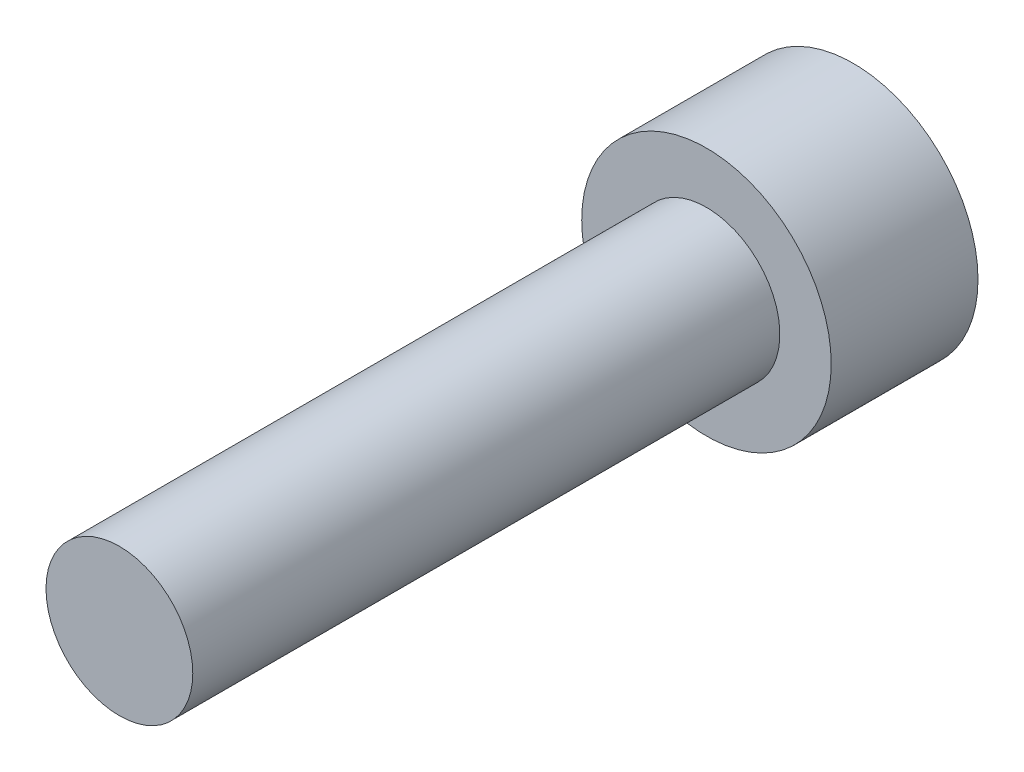
ISO-10303-21;
HEADER;
FILE_DESCRIPTION(('STEP AP214'),'2;1');
FILE_NAME('part.step','',(''),(''),'','','');
FILE_SCHEMA(('AUTOMOTIVE_DESIGN { 1 0 10303 214 1 1 1 1 }'));
ENDSEC;
DATA;
#1=APPLICATION_CONTEXT('core data for automotive mechanical design processes');
#2=APPLICATION_PROTOCOL_DEFINITION('international standard','automotive_design',2000,#1);
#3=PRODUCT_CONTEXT('',#1,'mechanical');
#4=PRODUCT('Part','Part','',(#3));
#5=PRODUCT_RELATED_PRODUCT_CATEGORY('part','',(#4));
#6=PRODUCT_DEFINITION_FORMATION('','',#4);
#7=PRODUCT_DEFINITION_CONTEXT('part definition',#1,'design');
#8=PRODUCT_DEFINITION('design','',#6,#7);
#9=PRODUCT_DEFINITION_SHAPE('','',#8);
#10=(LENGTH_UNIT() NAMED_UNIT(*) SI_UNIT(.MILLI.,.METRE.));
#11=(NAMED_UNIT(*) PLANE_ANGLE_UNIT() SI_UNIT($,.RADIAN.));
#12=(NAMED_UNIT(*) SI_UNIT($,.STERADIAN.) SOLID_ANGLE_UNIT());
#13=UNCERTAINTY_MEASURE_WITH_UNIT(LENGTH_MEASURE(1.E-05),#10,'distance_accuracy_value','');
#14=(GEOMETRIC_REPRESENTATION_CONTEXT(3) GLOBAL_UNCERTAINTY_ASSIGNED_CONTEXT((#13)) GLOBAL_UNIT_ASSIGNED_CONTEXT((#10,
#11,#12)) REPRESENTATION_CONTEXT('',''));
#15=CARTESIAN_POINT('',(0.,0.,0.));
#16=DIRECTION('',(0.,0.,1.));
#17=DIRECTION('',(1.,0.,0.));
#18=AXIS2_PLACEMENT_3D('',#15,#16,#17);
#19=CARTESIAN_POINT('',(0.,0.,20.));
#20=DIRECTION('',(0.,0.,-1.));
#21=DIRECTION('',(-1.,0.,0.));
#22=AXIS2_PLACEMENT_3D('',#19,#20,#21);
#23=CYLINDRICAL_SURFACE('',#22,2.5);
#24=CARTESIAN_POINT('',(0.,0.,20.));
#25=DIRECTION('',(0.,0.,1.));
#26=DIRECTION('',(1.,0.,0.));
#27=AXIS2_PLACEMENT_3D('',#24,#25,#26);
#28=CIRCLE('',#27,2.5);
#29=CARTESIAN_POINT('',(2.5,0.,20.));
#30=VERTEX_POINT('',#29);
#31=EDGE_CURVE('E11',#30,#30,#28,.T.);
#32=ORIENTED_EDGE('',*,*,#31,.F.);
#33=EDGE_LOOP('',(#32));
#34=FACE_BOUND('',#33,.T.);
#35=CARTESIAN_POINT('',(0.,0.,0.));
#36=DIRECTION('',(0.,0.,-1.));
#37=DIRECTION('',(-1.,0.,0.));
#38=AXIS2_PLACEMENT_3D('',#35,#36,#37);
#39=CIRCLE('',#38,2.5);
#40=CARTESIAN_POINT('',(-2.5,0.,0.));
#41=VERTEX_POINT('',#40);
#42=EDGE_CURVE('E42',#41,#41,#39,.T.);
#43=ORIENTED_EDGE('',*,*,#42,.F.);
#44=EDGE_LOOP('',(#43));
#45=FACE_BOUND('',#44,.T.);
#46=ADVANCED_FACE('F35',(#34,#45),#23,.T.);
#47=CARTESIAN_POINT('',(0.,0.,20.));
#48=DIRECTION('',(0.,0.,1.));
#49=DIRECTION('',(1.,0.,0.));
#50=AXIS2_PLACEMENT_3D('',#47,#48,#49);
#51=PLANE('',#50);
#52=ORIENTED_EDGE('',*,*,#31,.T.);
#53=EDGE_LOOP('',(#52));
#54=FACE_BOUND('',#53,.T.);
#55=ADVANCED_FACE('F152',(#54),#51,.T.);
#56=CARTESIAN_POINT('',(0.,0.,0.));
#57=DIRECTION('',(0.,0.,-1.));
#58=DIRECTION('',(-1.,0.,0.));
#59=AXIS2_PLACEMENT_3D('',#56,#57,#58);
#60=PLANE('',#59);
#61=CARTESIAN_POINT('',(0.,0.,0.));
#62=DIRECTION('',(0.,0.,-1.));
#63=DIRECTION('',(-1.,0.,0.));
#64=AXIS2_PLACEMENT_3D('',#61,#62,#63);
#65=CIRCLE('',#64,4.25);
#66=CARTESIAN_POINT('',(-4.25,0.,0.));
#67=VERTEX_POINT('',#66);
#68=EDGE_CURVE('E136',#67,#67,#65,.T.);
#69=ORIENTED_EDGE('',*,*,#68,.F.);
#70=EDGE_LOOP('',(#69));
#71=FACE_BOUND('',#70,.T.);
#72=ORIENTED_EDGE('',*,*,#42,.T.);
#73=EDGE_LOOP('',(#72));
#74=FACE_BOUND('',#73,.T.);
#75=ADVANCED_FACE('F149',(#71,#74),#60,.F.);
#76=CARTESIAN_POINT('',(0.,0.,-5.));
#77=DIRECTION('',(0.,0.,1.));
#78=DIRECTION('',(1.,0.,0.));
#79=AXIS2_PLACEMENT_3D('',#76,#77,#78);
#80=CYLINDRICAL_SURFACE('',#79,4.25);
#81=CARTESIAN_POINT('',(0.,0.,-5.));
#82=DIRECTION('',(0.,0.,-1.));
#83=DIRECTION('',(-1.,0.,0.));
#84=AXIS2_PLACEMENT_3D('',#81,#82,#83);
#85=CIRCLE('',#84,4.25);
#86=CARTESIAN_POINT('',(-4.25,0.,-5.));
#87=VERTEX_POINT('',#86);
#88=EDGE_CURVE('E142',#87,#87,#85,.T.);
#89=ORIENTED_EDGE('',*,*,#88,.F.);
#90=EDGE_LOOP('',(#89));
#91=FACE_BOUND('',#90,.T.);
#92=ORIENTED_EDGE('',*,*,#68,.T.);
#93=EDGE_LOOP('',(#92));
#94=FACE_BOUND('',#93,.T.);
#95=ADVANCED_FACE('F162',(#91,#94),#80,.T.);
#96=CARTESIAN_POINT('',(0.,0.,-5.));
#97=DIRECTION('',(0.,0.,-1.));
#98=DIRECTION('',(-1.,0.,0.));
#99=AXIS2_PLACEMENT_3D('',#96,#97,#98);
#100=PLANE('',#99);
#101=DIRECTION('',(0.449520565283959,0.893269982360758,0.));
#102=VECTOR('',#101,1.);
#103=CARTESIAN_POINT('',(-2.30560160346745,-0.132418198982074,-5.));
#104=LINE('',#103,#102);
#105=CARTESIAN_POINT('',(-2.30560160346745,-0.132418198982074,-5.));
#106=VERTEX_POINT('',#105);
#107=CARTESIAN_POINT('',(-1.26747832597558,1.93050046011791,-5.));
#108=VERTEX_POINT('',#107);
#109=EDGE_CURVE('E49',#106,#108,#104,.T.);
#110=ORIENTED_EDGE('',*,*,#109,.F.);
#111=DIRECTION('',(-0.548834214520515,0.835931220239829,0.));
#112=VECTOR('',#111,1.);
#113=CARTESIAN_POINT('',(-1.03812327749187,-2.06291865909998,-5.));
#114=LINE('',#113,#112);
#115=CARTESIAN_POINT('',(-1.03812327749187,-2.06291865909998,-5.));
#116=VERTEX_POINT('',#115);
#117=EDGE_CURVE('E132',#116,#106,#114,.T.);
#118=ORIENTED_EDGE('',*,*,#117,.F.);
#119=DIRECTION('',(-0.998354779804474,-0.057338762120929,0.));
#120=VECTOR('',#119,1.);
#121=CARTESIAN_POINT('',(1.26747832597558,-1.93050046011791,-5.));
#122=LINE('',#121,#120);
#123=CARTESIAN_POINT('',(1.26747832597558,-1.93050046011791,-5.));
#124=VERTEX_POINT('',#123);
#125=EDGE_CURVE('E130',#124,#116,#122,.T.);
#126=ORIENTED_EDGE('',*,*,#125,.F.);
#127=DIRECTION('',(-0.449520565283959,-0.893269982360758,0.));
#128=VECTOR('',#127,1.);
#129=CARTESIAN_POINT('',(2.30560160346745,0.132418198982075,-5.));
#130=LINE('',#129,#128);
#131=CARTESIAN_POINT('',(2.30560160346745,0.132418198982075,-5.));
#132=VERTEX_POINT('',#131);
#133=EDGE_CURVE('E97',#132,#124,#130,.T.);
#134=ORIENTED_EDGE('',*,*,#133,.F.);
#135=DIRECTION('',(0.548834214520515,-0.835931220239829,0.));
#136=VECTOR('',#135,1.);
#137=CARTESIAN_POINT('',(1.03812327749187,2.06291865909999,-5.));
#138=LINE('',#137,#136);
#139=CARTESIAN_POINT('',(1.03812327749187,2.06291865909999,-5.));
#140=VERTEX_POINT('',#139);
#141=EDGE_CURVE('E126',#140,#132,#138,.T.);
#142=ORIENTED_EDGE('',*,*,#141,.F.);
#143=DIRECTION('',(0.998354779804474,0.0573387621209294,0.));
#144=VECTOR('',#143,1.);
#145=CARTESIAN_POINT('',(-1.26747832597558,1.93050046011791,-5.));
#146=LINE('',#145,#144);
#147=EDGE_CURVE('E123',#108,#140,#146,.T.);
#148=ORIENTED_EDGE('',*,*,#147,.F.);
#149=EDGE_LOOP('',(#110,#118,#126,#134,#142,#148));
#150=FACE_BOUND('',#149,.T.);
#151=ORIENTED_EDGE('',*,*,#88,.T.);
#152=EDGE_LOOP('',(#151));
#153=FACE_BOUND('',#152,.T.);
#154=ADVANCED_FACE('F167',(#150,#153),#100,.T.);
#155=CARTESIAN_POINT('',(-2.30560160346745,-0.132418198982074,-2.5));
#156=DIRECTION('',(-0.893269982360758,0.449520565283959,0.));
#157=DIRECTION('',(-0.449520565283959,-0.893269982360758,0.));
#158=AXIS2_PLACEMENT_3D('',#155,#156,#157);
#159=PLANE('',#158);
#160=ORIENTED_EDGE('',*,*,#109,.T.);
#161=DIRECTION('',(0.,0.,-1.));
#162=VECTOR('',#161,1.);
#163=CARTESIAN_POINT('',(-1.26747832597558,1.93050046011791,-2.5));
#164=LINE('',#163,#162);
#165=CARTESIAN_POINT('',(-1.26747832597558,1.93050046011791,-2.5));
#166=VERTEX_POINT('',#165);
#167=EDGE_CURVE('E79',#166,#108,#164,.T.);
#168=ORIENTED_EDGE('',*,*,#167,.F.);
#169=DIRECTION('',(0.449520565283959,0.893269982360758,0.));
#170=VECTOR('',#169,1.);
#171=CARTESIAN_POINT('',(-2.30560160346745,-0.132418198982074,-2.5));
#172=LINE('',#171,#170);
#173=CARTESIAN_POINT('',(-2.30560160346745,-0.132418198982074,-2.5));
#174=VERTEX_POINT('',#173);
#175=EDGE_CURVE('E134',#174,#166,#172,.T.);
#176=ORIENTED_EDGE('',*,*,#175,.F.);
#177=DIRECTION('',(0.,0.,-1.));
#178=VECTOR('',#177,1.);
#179=CARTESIAN_POINT('',(-2.30560160346745,-0.132418198982074,-2.5));
#180=LINE('',#179,#178);
#181=EDGE_CURVE('E57',#174,#106,#180,.T.);
#182=ORIENTED_EDGE('',*,*,#181,.T.);
#183=EDGE_LOOP('',(#160,#168,#176,#182));
#184=FACE_BOUND('',#183,.T.);
#185=ADVANCED_FACE('F172',(#184),#159,.F.);
#186=CARTESIAN_POINT('',(-1.03812327749187,-2.06291865909998,-2.5));
#187=DIRECTION('',(-0.835931220239829,-0.548834214520515,0.));
#188=DIRECTION('',(0.548834214520515,-0.835931220239829,0.));
#189=AXIS2_PLACEMENT_3D('',#186,#187,#188);
#190=PLANE('',#189);
#191=ORIENTED_EDGE('',*,*,#117,.T.);
#192=ORIENTED_EDGE('',*,*,#181,.F.);
#193=DIRECTION('',(-0.548834214520515,0.835931220239829,0.));
#194=VECTOR('',#193,1.);
#195=CARTESIAN_POINT('',(-1.03812327749187,-2.06291865909998,-2.5));
#196=LINE('',#195,#194);
#197=CARTESIAN_POINT('',(-1.03812327749187,-2.06291865909998,-2.5));
#198=VERTEX_POINT('',#197);
#199=EDGE_CURVE('E109',#198,#174,#196,.T.);
#200=ORIENTED_EDGE('',*,*,#199,.F.);
#201=DIRECTION('',(0.,0.,-1.));
#202=VECTOR('',#201,1.);
#203=CARTESIAN_POINT('',(-1.03812327749187,-2.06291865909998,-2.5));
#204=LINE('',#203,#202);
#205=EDGE_CURVE('E101',#198,#116,#204,.T.);
#206=ORIENTED_EDGE('',*,*,#205,.T.);
#207=EDGE_LOOP('',(#191,#192,#200,#206));
#208=FACE_BOUND('',#207,.T.);
#209=ADVANCED_FACE('F176',(#208),#190,.F.);
#210=CARTESIAN_POINT('',(1.26747832597558,-1.93050046011791,-2.5));
#211=DIRECTION('',(0.057338762120929,-0.998354779804474,0.));
#212=DIRECTION('',(0.998354779804474,0.057338762120929,0.));
#213=AXIS2_PLACEMENT_3D('',#210,#211,#212);
#214=PLANE('',#213);
#215=ORIENTED_EDGE('',*,*,#125,.T.);
#216=ORIENTED_EDGE('',*,*,#205,.F.);
#217=DIRECTION('',(-0.998354779804474,-0.057338762120929,0.));
#218=VECTOR('',#217,1.);
#219=CARTESIAN_POINT('',(1.26747832597558,-1.93050046011791,-2.5));
#220=LINE('',#219,#218);
#221=CARTESIAN_POINT('',(1.26747832597558,-1.93050046011791,-2.5));
#222=VERTEX_POINT('',#221);
#223=EDGE_CURVE('E105',#222,#198,#220,.T.);
#224=ORIENTED_EDGE('',*,*,#223,.F.);
#225=DIRECTION('',(0.,0.,-1.));
#226=VECTOR('',#225,1.);
#227=CARTESIAN_POINT('',(1.26747832597558,-1.93050046011791,-2.5));
#228=LINE('',#227,#226);
#229=EDGE_CURVE('E90',#222,#124,#228,.T.);
#230=ORIENTED_EDGE('',*,*,#229,.T.);
#231=EDGE_LOOP('',(#215,#216,#224,#230));
#232=FACE_BOUND('',#231,.T.);
#233=ADVANCED_FACE('F106',(#232),#214,.F.);
#234=CARTESIAN_POINT('',(2.30560160346745,0.132418198982075,-2.5));
#235=DIRECTION('',(0.893269982360758,-0.449520565283959,0.));
#236=DIRECTION('',(0.449520565283959,0.893269982360758,0.));
#237=AXIS2_PLACEMENT_3D('',#234,#235,#236);
#238=PLANE('',#237);
#239=ORIENTED_EDGE('',*,*,#133,.T.);
#240=ORIENTED_EDGE('',*,*,#229,.F.);
#241=DIRECTION('',(-0.449520565283959,-0.893269982360758,0.));
#242=VECTOR('',#241,1.);
#243=CARTESIAN_POINT('',(2.30560160346745,0.132418198982075,-2.5));
#244=LINE('',#243,#242);
#245=CARTESIAN_POINT('',(2.30560160346745,0.132418198982075,-2.5));
#246=VERTEX_POINT('',#245);
#247=EDGE_CURVE('E94',#246,#222,#244,.T.);
#248=ORIENTED_EDGE('',*,*,#247,.F.);
#249=DIRECTION('',(0.,0.,-1.));
#250=VECTOR('',#249,1.);
#251=CARTESIAN_POINT('',(2.30560160346745,0.132418198982075,-2.5));
#252=LINE('',#251,#250);
#253=EDGE_CURVE('E102',#246,#132,#252,.T.);
#254=ORIENTED_EDGE('',*,*,#253,.T.);
#255=EDGE_LOOP('',(#239,#240,#248,#254));
#256=FACE_BOUND('',#255,.T.);
#257=ADVANCED_FACE('F92',(#256),#238,.F.);
#258=CARTESIAN_POINT('',(1.03812327749187,2.06291865909999,-2.5));
#259=DIRECTION('',(0.835931220239829,0.548834214520515,0.));
#260=DIRECTION('',(-0.548834214520515,0.835931220239829,0.));
#261=AXIS2_PLACEMENT_3D('',#258,#259,#260);
#262=PLANE('',#261);
#263=ORIENTED_EDGE('',*,*,#141,.T.);
#264=ORIENTED_EDGE('',*,*,#253,.F.);
#265=DIRECTION('',(0.548834214520515,-0.835931220239829,0.));
#266=VECTOR('',#265,1.);
#267=CARTESIAN_POINT('',(1.03812327749187,2.06291865909999,-2.5));
#268=LINE('',#267,#266);
#269=CARTESIAN_POINT('',(1.03812327749187,2.06291865909999,-2.5));
#270=VERTEX_POINT('',#269);
#271=EDGE_CURVE('E115',#270,#246,#268,.T.);
#272=ORIENTED_EDGE('',*,*,#271,.F.);
#273=DIRECTION('',(0.,0.,-1.));
#274=VECTOR('',#273,1.);
#275=CARTESIAN_POINT('',(1.03812327749187,2.06291865909999,-2.5));
#276=LINE('',#275,#274);
#277=EDGE_CURVE('E139',#270,#140,#276,.T.);
#278=ORIENTED_EDGE('',*,*,#277,.T.);
#279=EDGE_LOOP('',(#263,#264,#272,#278));
#280=FACE_BOUND('',#279,.T.);
#281=ADVANCED_FACE('F180',(#280),#262,.F.);
#282=CARTESIAN_POINT('',(-1.26747832597558,1.93050046011791,-2.5));
#283=DIRECTION('',(-0.0573387621209294,0.998354779804474,0.));
#284=DIRECTION('',(-0.998354779804474,-0.0573387621209294,0.));
#285=AXIS2_PLACEMENT_3D('',#282,#283,#284);
#286=PLANE('',#285);
#287=ORIENTED_EDGE('',*,*,#147,.T.);
#288=ORIENTED_EDGE('',*,*,#277,.F.);
#289=DIRECTION('',(0.998354779804474,0.0573387621209294,0.));
#290=VECTOR('',#289,1.);
#291=CARTESIAN_POINT('',(-1.26747832597558,1.93050046011791,-2.5));
#292=LINE('',#291,#290);
#293=EDGE_CURVE('E117',#166,#270,#292,.T.);
#294=ORIENTED_EDGE('',*,*,#293,.F.);
#295=ORIENTED_EDGE('',*,*,#167,.T.);
#296=EDGE_LOOP('',(#287,#288,#294,#295));
#297=FACE_BOUND('',#296,.T.);
#298=ADVANCED_FACE('F177',(#297),#286,.F.);
#299=CARTESIAN_POINT('',(0.,0.,-2.5));
#300=DIRECTION('',(0.,0.,-1.));
#301=DIRECTION('',(-1.,0.,0.));
#302=AXIS2_PLACEMENT_3D('',#299,#300,#301);
#303=PLANE('',#302);
#304=ORIENTED_EDGE('',*,*,#175,.T.);
#305=ORIENTED_EDGE('',*,*,#293,.T.);
#306=ORIENTED_EDGE('',*,*,#271,.T.);
#307=ORIENTED_EDGE('',*,*,#247,.T.);
#308=ORIENTED_EDGE('',*,*,#223,.T.);
#309=ORIENTED_EDGE('',*,*,#199,.T.);
#310=EDGE_LOOP('',(#304,#305,#306,#307,#308,#309));
#311=FACE_BOUND('',#310,.T.);
#312=ADVANCED_FACE('F112',(#311),#303,.T.);
#313=CLOSED_SHELL('',(#46,#55,#75,#95,#154,#185,#209,#233,#257,#281,#298,#312));
#314=MANIFOLD_SOLID_BREP('B2',#313);
#315=ADVANCED_BREP_SHAPE_REPRESENTATION('',(#18,#314),#14);
#316=SHAPE_DEFINITION_REPRESENTATION(#9,#315);
ENDSEC;
END-ISO-10303-21;
